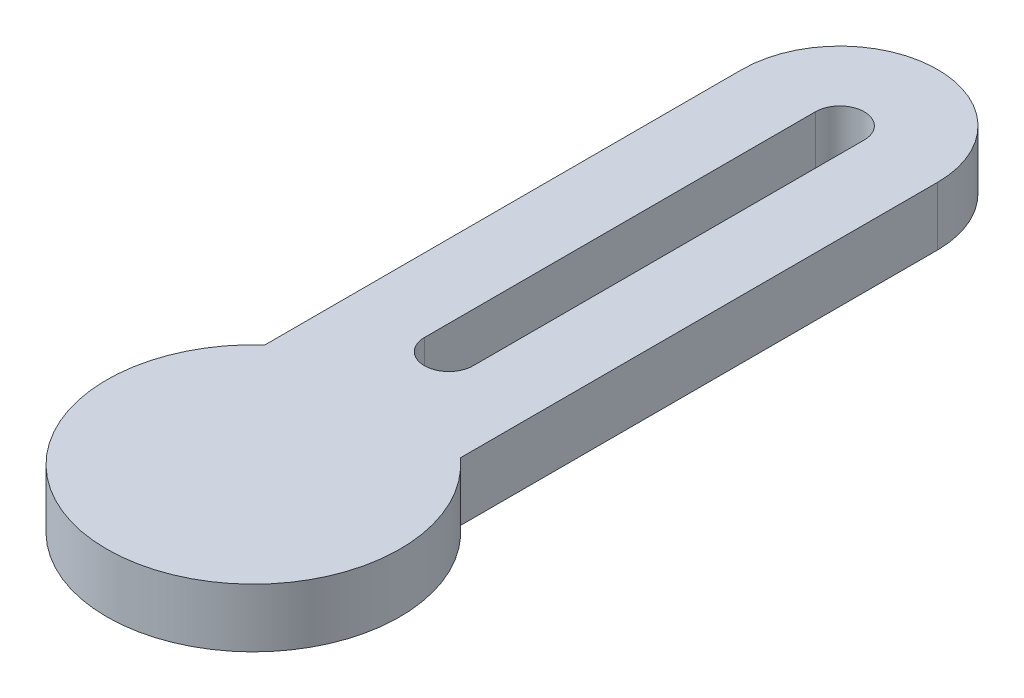
ISO-10303-21;
HEADER;
FILE_DESCRIPTION(('STEP AP214'),'2;1');
FILE_NAME('part.step','',(''),(''),'','','');
FILE_SCHEMA(('AUTOMOTIVE_DESIGN { 1 0 10303 214 1 1 1 1 }'));
ENDSEC;
DATA;
#1=APPLICATION_CONTEXT('core data for automotive mechanical design processes');
#2=APPLICATION_PROTOCOL_DEFINITION('international standard','automotive_design',2000,#1);
#3=PRODUCT_CONTEXT('',#1,'mechanical');
#4=PRODUCT('Part','Part','',(#3));
#5=PRODUCT_RELATED_PRODUCT_CATEGORY('part','',(#4));
#6=PRODUCT_DEFINITION_FORMATION('','',#4);
#7=PRODUCT_DEFINITION_CONTEXT('part definition',#1,'design');
#8=PRODUCT_DEFINITION('design','',#6,#7);
#9=PRODUCT_DEFINITION_SHAPE('','',#8);
#10=(LENGTH_UNIT() NAMED_UNIT(*) SI_UNIT(.MILLI.,.METRE.));
#11=(NAMED_UNIT(*) PLANE_ANGLE_UNIT() SI_UNIT($,.RADIAN.));
#12=(NAMED_UNIT(*) SI_UNIT($,.STERADIAN.) SOLID_ANGLE_UNIT());
#13=UNCERTAINTY_MEASURE_WITH_UNIT(LENGTH_MEASURE(1.E-05),#10,'distance_accuracy_value','');
#14=(GEOMETRIC_REPRESENTATION_CONTEXT(3) GLOBAL_UNCERTAINTY_ASSIGNED_CONTEXT((#13)) GLOBAL_UNIT_ASSIGNED_CONTEXT((#10,
#11,#12)) REPRESENTATION_CONTEXT('',''));
#15=CARTESIAN_POINT('',(0.,0.,0.));
#16=DIRECTION('',(0.,0.,1.));
#17=DIRECTION('',(1.,0.,0.));
#18=AXIS2_PLACEMENT_3D('',#15,#16,#17);
#19=CARTESIAN_POINT('',(0.,3.,-10.));
#20=DIRECTION('',(0.,-1.,0.));
#21=DIRECTION('',(0.,0.,-1.));
#22=AXIS2_PLACEMENT_3D('',#19,#20,#21);
#23=CYLINDRICAL_SURFACE('',#22,1.25);
#24=CARTESIAN_POINT('',(0.,0.,-10.));
#25=DIRECTION('',(0.,1.,0.));
#26=DIRECTION('',(0.,0.,1.));
#27=AXIS2_PLACEMENT_3D('',#24,#25,#26);
#28=CIRCLE('',#27,1.25);
#29=CARTESIAN_POINT('',(-1.25,0.,-10.));
#30=VERTEX_POINT('',#29);
#31=CARTESIAN_POINT('',(1.25,0.,-10.));
#32=VERTEX_POINT('',#31);
#33=EDGE_CURVE('E143',#30,#32,#28,.T.);
#34=ORIENTED_EDGE('',*,*,#33,.F.);
#35=DIRECTION('',(0.,-1.,0.));
#36=VECTOR('',#35,1.);
#37=CARTESIAN_POINT('',(-1.25,3.,-10.));
#38=LINE('',#37,#36);
#39=CARTESIAN_POINT('',(-1.25,3.,-10.));
#40=VERTEX_POINT('',#39);
#41=EDGE_CURVE('E11',#40,#30,#38,.T.);
#42=ORIENTED_EDGE('',*,*,#41,.F.);
#43=CARTESIAN_POINT('',(0.,3.,-10.));
#44=DIRECTION('',(0.,1.,0.));
#45=DIRECTION('',(0.,0.,1.));
#46=AXIS2_PLACEMENT_3D('',#43,#44,#45);
#47=CIRCLE('',#46,1.25);
#48=CARTESIAN_POINT('',(1.25,3.,-10.));
#49=VERTEX_POINT('',#48);
#50=EDGE_CURVE('E124',#40,#49,#47,.T.);
#51=ORIENTED_EDGE('',*,*,#50,.T.);
#52=DIRECTION('',(0.,-1.,0.));
#53=VECTOR('',#52,1.);
#54=CARTESIAN_POINT('',(1.25,3.,-10.));
#55=LINE('',#54,#53);
#56=EDGE_CURVE('E88',#49,#32,#55,.T.);
#57=ORIENTED_EDGE('',*,*,#56,.T.);
#58=EDGE_LOOP('',(#34,#42,#51,#57));
#59=FACE_BOUND('',#58,.T.);
#60=ADVANCED_FACE('F35',(#59),#23,.F.);
#61=CARTESIAN_POINT('',(-1.25,3.,0.));
#62=DIRECTION('',(1.,0.,0.));
#63=DIRECTION('',(0.,0.,-1.));
#64=AXIS2_PLACEMENT_3D('',#61,#62,#63);
#65=PLANE('',#64);
#66=DIRECTION('',(0.,0.,1.));
#67=VECTOR('',#66,1.);
#68=CARTESIAN_POINT('',(-1.25,0.,0.));
#69=LINE('',#68,#67);
#70=CARTESIAN_POINT('',(-1.25,0.,-30.));
#71=VERTEX_POINT('',#70);
#72=EDGE_CURVE('E116',#71,#30,#69,.T.);
#73=ORIENTED_EDGE('',*,*,#72,.F.);
#74=DIRECTION('',(0.,-1.,0.));
#75=VECTOR('',#74,1.);
#76=CARTESIAN_POINT('',(-1.25,3.,-30.));
#77=LINE('',#76,#75);
#78=CARTESIAN_POINT('',(-1.25,3.,-30.));
#79=VERTEX_POINT('',#78);
#80=EDGE_CURVE('E45',#79,#71,#77,.T.);
#81=ORIENTED_EDGE('',*,*,#80,.F.);
#82=DIRECTION('',(0.,0.,1.));
#83=VECTOR('',#82,1.);
#84=CARTESIAN_POINT('',(-1.25,3.,0.));
#85=LINE('',#84,#83);
#86=EDGE_CURVE('E114',#79,#40,#85,.T.);
#87=ORIENTED_EDGE('',*,*,#86,.T.);
#88=ORIENTED_EDGE('',*,*,#41,.T.);
#89=EDGE_LOOP('',(#73,#81,#87,#88));
#90=FACE_BOUND('',#89,.T.);
#91=ADVANCED_FACE('F113',(#90),#65,.T.);
#92=CARTESIAN_POINT('',(0.,3.,-30.));
#93=DIRECTION('',(0.,-1.,0.));
#94=DIRECTION('',(0.,0.,-1.));
#95=AXIS2_PLACEMENT_3D('',#92,#93,#94);
#96=CYLINDRICAL_SURFACE('',#95,1.25);
#97=CARTESIAN_POINT('',(0.,0.,-30.));
#98=DIRECTION('',(0.,1.,0.));
#99=DIRECTION('',(0.,0.,1.));
#100=AXIS2_PLACEMENT_3D('',#97,#98,#99);
#101=CIRCLE('',#100,1.25);
#102=CARTESIAN_POINT('',(1.25,0.,-30.));
#103=VERTEX_POINT('',#102);
#104=EDGE_CURVE('E147',#103,#71,#101,.T.);
#105=ORIENTED_EDGE('',*,*,#104,.F.);
#106=DIRECTION('',(0.,-1.,0.));
#107=VECTOR('',#106,1.);
#108=CARTESIAN_POINT('',(1.25,3.,-30.));
#109=LINE('',#108,#107);
#110=CARTESIAN_POINT('',(1.25,3.,-30.));
#111=VERTEX_POINT('',#110);
#112=EDGE_CURVE('E81',#111,#103,#109,.T.);
#113=ORIENTED_EDGE('',*,*,#112,.F.);
#114=CARTESIAN_POINT('',(0.,3.,-30.));
#115=DIRECTION('',(0.,1.,0.));
#116=DIRECTION('',(0.,0.,1.));
#117=AXIS2_PLACEMENT_3D('',#114,#115,#116);
#118=CIRCLE('',#117,1.25);
#119=EDGE_CURVE('E123',#111,#79,#118,.T.);
#120=ORIENTED_EDGE('',*,*,#119,.T.);
#121=ORIENTED_EDGE('',*,*,#80,.T.);
#122=EDGE_LOOP('',(#105,#113,#120,#121));
#123=FACE_BOUND('',#122,.T.);
#124=ADVANCED_FACE('F126',(#123),#96,.F.);
#125=CARTESIAN_POINT('',(0.,3.,0.));
#126=DIRECTION('',(0.,-1.,0.));
#127=DIRECTION('',(0.,0.,-1.));
#128=AXIS2_PLACEMENT_3D('',#125,#126,#127);
#129=CYLINDRICAL_SURFACE('',#128,7.5);
#130=CARTESIAN_POINT('',(0.,0.,0.));
#131=DIRECTION('',(0.,1.,0.));
#132=DIRECTION('',(0.,0.,1.));
#133=AXIS2_PLACEMENT_3D('',#130,#131,#132);
#134=CIRCLE('',#133,7.5);
#135=CARTESIAN_POINT('',(-5.,0.,-5.59016994374947));
#136=VERTEX_POINT('',#135);
#137=CARTESIAN_POINT('',(5.,0.,-5.59016994374947));
#138=VERTEX_POINT('',#137);
#139=EDGE_CURVE('E132',#136,#138,#134,.T.);
#140=ORIENTED_EDGE('',*,*,#139,.T.);
#141=DIRECTION('',(0.,-1.,0.));
#142=VECTOR('',#141,1.);
#143=CARTESIAN_POINT('',(5.,3.,-5.59016994374947));
#144=LINE('',#143,#142);
#145=CARTESIAN_POINT('',(5.,3.,-5.59016994374947));
#146=VERTEX_POINT('',#145);
#147=EDGE_CURVE('E39',#146,#138,#144,.T.);
#148=ORIENTED_EDGE('',*,*,#147,.F.);
#149=CARTESIAN_POINT('',(0.,3.,0.));
#150=DIRECTION('',(0.,1.,0.));
#151=DIRECTION('',(0.,0.,1.));
#152=AXIS2_PLACEMENT_3D('',#149,#150,#151);
#153=CIRCLE('',#152,7.5);
#154=CARTESIAN_POINT('',(-5.,3.,-5.59016994374947));
#155=VERTEX_POINT('',#154);
#156=EDGE_CURVE('E151',#155,#146,#153,.T.);
#157=ORIENTED_EDGE('',*,*,#156,.F.);
#158=DIRECTION('',(0.,-1.,0.));
#159=VECTOR('',#158,1.);
#160=CARTESIAN_POINT('',(-5.,3.,-5.59016994374947));
#161=LINE('',#160,#159);
#162=EDGE_CURVE('E128',#155,#136,#161,.T.);
#163=ORIENTED_EDGE('',*,*,#162,.T.);
#164=EDGE_LOOP('',(#140,#148,#157,#163));
#165=FACE_BOUND('',#164,.T.);
#166=ADVANCED_FACE('F37',(#165),#129,.T.);
#167=CARTESIAN_POINT('',(5.,3.,0.));
#168=DIRECTION('',(-1.,0.,0.));
#169=DIRECTION('',(0.,0.,1.));
#170=AXIS2_PLACEMENT_3D('',#167,#168,#169);
#171=PLANE('',#170);
#172=DIRECTION('',(0.,0.,-1.));
#173=VECTOR('',#172,1.);
#174=CARTESIAN_POINT('',(5.,0.,0.));
#175=LINE('',#174,#173);
#176=CARTESIAN_POINT('',(5.,0.,-30.));
#177=VERTEX_POINT('',#176);
#178=EDGE_CURVE('E135',#138,#177,#175,.T.);
#179=ORIENTED_EDGE('',*,*,#178,.T.);
#180=DIRECTION('',(0.,-1.,0.));
#181=VECTOR('',#180,1.);
#182=CARTESIAN_POINT('',(5.,3.,-30.));
#183=LINE('',#182,#181);
#184=CARTESIAN_POINT('',(5.,3.,-30.));
#185=VERTEX_POINT('',#184);
#186=EDGE_CURVE('E156',#185,#177,#183,.T.);
#187=ORIENTED_EDGE('',*,*,#186,.F.);
#188=DIRECTION('',(0.,0.,-1.));
#189=VECTOR('',#188,1.);
#190=CARTESIAN_POINT('',(5.,3.,0.));
#191=LINE('',#190,#189);
#192=EDGE_CURVE('E96',#146,#185,#191,.T.);
#193=ORIENTED_EDGE('',*,*,#192,.F.);
#194=ORIENTED_EDGE('',*,*,#147,.T.);
#195=EDGE_LOOP('',(#179,#187,#193,#194));
#196=FACE_BOUND('',#195,.T.);
#197=ADVANCED_FACE('F162',(#196),#171,.F.);
#198=CARTESIAN_POINT('',(0.,3.,-30.));
#199=DIRECTION('',(0.,-1.,0.));
#200=DIRECTION('',(0.,0.,-1.));
#201=AXIS2_PLACEMENT_3D('',#198,#199,#200);
#202=CYLINDRICAL_SURFACE('',#201,5.);
#203=CARTESIAN_POINT('',(0.,0.,-30.));
#204=DIRECTION('',(0.,1.,0.));
#205=DIRECTION('',(0.,0.,1.));
#206=AXIS2_PLACEMENT_3D('',#203,#204,#205);
#207=CIRCLE('',#206,5.);
#208=CARTESIAN_POINT('',(-5.,0.,-30.));
#209=VERTEX_POINT('',#208);
#210=EDGE_CURVE('E137',#177,#209,#207,.T.);
#211=ORIENTED_EDGE('',*,*,#210,.T.);
#212=DIRECTION('',(0.,-1.,0.));
#213=VECTOR('',#212,1.);
#214=CARTESIAN_POINT('',(-5.,3.,-30.));
#215=LINE('',#214,#213);
#216=CARTESIAN_POINT('',(-5.,3.,-30.));
#217=VERTEX_POINT('',#216);
#218=EDGE_CURVE('E155',#217,#209,#215,.T.);
#219=ORIENTED_EDGE('',*,*,#218,.F.);
#220=CARTESIAN_POINT('',(0.,3.,-30.));
#221=DIRECTION('',(0.,1.,0.));
#222=DIRECTION('',(0.,0.,1.));
#223=AXIS2_PLACEMENT_3D('',#220,#221,#222);
#224=CIRCLE('',#223,5.);
#225=EDGE_CURVE('E203',#185,#217,#224,.T.);
#226=ORIENTED_EDGE('',*,*,#225,.F.);
#227=ORIENTED_EDGE('',*,*,#186,.T.);
#228=EDGE_LOOP('',(#211,#219,#226,#227));
#229=FACE_BOUND('',#228,.T.);
#230=ADVANCED_FACE('F176',(#229),#202,.T.);
#231=CARTESIAN_POINT('',(-5.,3.,0.));
#232=DIRECTION('',(-1.,0.,0.));
#233=DIRECTION('',(0.,0.,1.));
#234=AXIS2_PLACEMENT_3D('',#231,#232,#233);
#235=PLANE('',#234);
#236=DIRECTION('',(0.,0.,-1.));
#237=VECTOR('',#236,1.);
#238=CARTESIAN_POINT('',(-5.,0.,0.));
#239=LINE('',#238,#237);
#240=EDGE_CURVE('E140',#136,#209,#239,.T.);
#241=ORIENTED_EDGE('',*,*,#240,.F.);
#242=ORIENTED_EDGE('',*,*,#162,.F.);
#243=DIRECTION('',(0.,0.,-1.));
#244=VECTOR('',#243,1.);
#245=CARTESIAN_POINT('',(-5.,3.,0.));
#246=LINE('',#245,#244);
#247=EDGE_CURVE('E175',#155,#217,#246,.T.);
#248=ORIENTED_EDGE('',*,*,#247,.T.);
#249=ORIENTED_EDGE('',*,*,#218,.T.);
#250=EDGE_LOOP('',(#241,#242,#248,#249));
#251=FACE_BOUND('',#250,.T.);
#252=ADVANCED_FACE('F171',(#251),#235,.T.);
#253=CARTESIAN_POINT('',(1.25,3.,0.));
#254=DIRECTION('',(1.,0.,0.));
#255=DIRECTION('',(0.,0.,-1.));
#256=AXIS2_PLACEMENT_3D('',#253,#254,#255);
#257=PLANE('',#256);
#258=DIRECTION('',(0.,0.,1.));
#259=VECTOR('',#258,1.);
#260=CARTESIAN_POINT('',(1.25,0.,0.));
#261=LINE('',#260,#259);
#262=EDGE_CURVE('E149',#103,#32,#261,.T.);
#263=ORIENTED_EDGE('',*,*,#262,.T.);
#264=ORIENTED_EDGE('',*,*,#56,.F.);
#265=DIRECTION('',(0.,0.,1.));
#266=VECTOR('',#265,1.);
#267=CARTESIAN_POINT('',(1.25,3.,0.));
#268=LINE('',#267,#266);
#269=EDGE_CURVE('E54',#111,#49,#268,.T.);
#270=ORIENTED_EDGE('',*,*,#269,.F.);
#271=ORIENTED_EDGE('',*,*,#112,.T.);
#272=EDGE_LOOP('',(#263,#264,#270,#271));
#273=FACE_BOUND('',#272,.T.);
#274=ADVANCED_FACE('F183',(#273),#257,.F.);
#275=CARTESIAN_POINT('',(0.,3.,0.));
#276=DIRECTION('',(0.,1.,0.));
#277=DIRECTION('',(0.,0.,1.));
#278=AXIS2_PLACEMENT_3D('',#275,#276,#277);
#279=PLANE('',#278);
#280=ORIENTED_EDGE('',*,*,#156,.T.);
#281=ORIENTED_EDGE('',*,*,#192,.T.);
#282=ORIENTED_EDGE('',*,*,#225,.T.);
#283=ORIENTED_EDGE('',*,*,#247,.F.);
#284=EDGE_LOOP('',(#280,#281,#282,#283));
#285=FACE_BOUND('',#284,.T.);
#286=ORIENTED_EDGE('',*,*,#50,.F.);
#287=ORIENTED_EDGE('',*,*,#86,.F.);
#288=ORIENTED_EDGE('',*,*,#119,.F.);
#289=ORIENTED_EDGE('',*,*,#269,.T.);
#290=EDGE_LOOP('',(#286,#287,#288,#289));
#291=FACE_BOUND('',#290,.T.);
#292=ADVANCED_FACE('F122',(#285,#291),#279,.T.);
#293=CARTESIAN_POINT('',(0.,0.,0.));
#294=DIRECTION('',(0.,1.,0.));
#295=DIRECTION('',(0.,0.,1.));
#296=AXIS2_PLACEMENT_3D('',#293,#294,#295);
#297=PLANE('',#296);
#298=ORIENTED_EDGE('',*,*,#139,.F.);
#299=ORIENTED_EDGE('',*,*,#240,.T.);
#300=ORIENTED_EDGE('',*,*,#210,.F.);
#301=ORIENTED_EDGE('',*,*,#178,.F.);
#302=EDGE_LOOP('',(#298,#299,#300,#301));
#303=FACE_BOUND('',#302,.T.);
#304=ORIENTED_EDGE('',*,*,#33,.T.);
#305=ORIENTED_EDGE('',*,*,#262,.F.);
#306=ORIENTED_EDGE('',*,*,#104,.T.);
#307=ORIENTED_EDGE('',*,*,#72,.T.);
#308=EDGE_LOOP('',(#304,#305,#306,#307));
#309=FACE_BOUND('',#308,.T.);
#310=ADVANCED_FACE('F168',(#303,#309),#297,.F.);
#311=CLOSED_SHELL('',(#60,#91,#124,#166,#197,#230,#252,#274,#292,#310));
#312=MANIFOLD_SOLID_BREP('B2',#311);
#313=ADVANCED_BREP_SHAPE_REPRESENTATION('',(#18,#312),#14);
#314=SHAPE_DEFINITION_REPRESENTATION(#9,#313);
ENDSEC;
END-ISO-10303-21;
